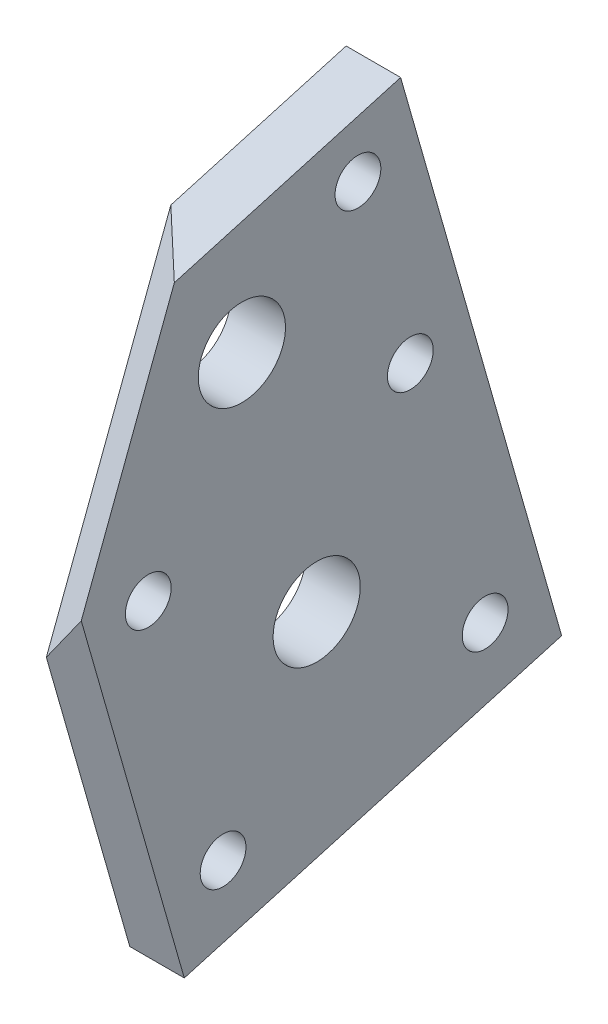
ISO-10303-21;
HEADER;
FILE_DESCRIPTION(('STEP AP214'),'2;1');
FILE_NAME('part.step','',(''),(''),'','','');
FILE_SCHEMA(('AUTOMOTIVE_DESIGN { 1 0 10303 214 1 1 1 1 }'));
ENDSEC;
DATA;
#1=APPLICATION_CONTEXT('core data for automotive mechanical design processes');
#2=APPLICATION_PROTOCOL_DEFINITION('international standard','automotive_design',2000,#1);
#3=PRODUCT_CONTEXT('',#1,'mechanical');
#4=PRODUCT('Part','Part','',(#3));
#5=PRODUCT_RELATED_PRODUCT_CATEGORY('part','',(#4));
#6=PRODUCT_DEFINITION_FORMATION('','',#4);
#7=PRODUCT_DEFINITION_CONTEXT('part definition',#1,'design');
#8=PRODUCT_DEFINITION('design','',#6,#7);
#9=PRODUCT_DEFINITION_SHAPE('','',#8);
#10=(LENGTH_UNIT() NAMED_UNIT(*) SI_UNIT(.MILLI.,.METRE.));
#11=(NAMED_UNIT(*) PLANE_ANGLE_UNIT() SI_UNIT($,.RADIAN.));
#12=(NAMED_UNIT(*) SI_UNIT($,.STERADIAN.) SOLID_ANGLE_UNIT());
#13=UNCERTAINTY_MEASURE_WITH_UNIT(LENGTH_MEASURE(1.E-05),#10,'distance_accuracy_value','');
#14=(GEOMETRIC_REPRESENTATION_CONTEXT(3) GLOBAL_UNCERTAINTY_ASSIGNED_CONTEXT((#13)) GLOBAL_UNIT_ASSIGNED_CONTEXT((#10,
#11,#12)) REPRESENTATION_CONTEXT('',''));
#15=CARTESIAN_POINT('',(0.,0.,0.));
#16=DIRECTION('',(0.,0.,1.));
#17=DIRECTION('',(1.,0.,0.));
#18=AXIS2_PLACEMENT_3D('',#15,#16,#17);
#19=CARTESIAN_POINT('',(-196.823635178426,3024.26393226236,-1427.03867727678));
#20=DIRECTION('',(1.,0.,0.));
#21=DIRECTION('',(0.,0.,-1.));
#22=AXIS2_PLACEMENT_3D('',#19,#20,#21);
#23=PLANE('',#22);
#24=CARTESIAN_POINT('',(-196.823635178426,3053.53065184557,-1506.59231650913));
#25=DIRECTION('',(-1.,0.,0.));
#26=DIRECTION('',(0.,0.,1.));
#27=AXIS2_PLACEMENT_3D('',#24,#25,#26);
#28=CIRCLE('',#27,2.09999999999971);
#29=CARTESIAN_POINT('',(-196.823635178426,3053.53065184557,-1504.49231650913));
#30=VERTEX_POINT('',#29);
#31=EDGE_CURVE('E185',#30,#30,#28,.T.);
#32=ORIENTED_EDGE('',*,*,#31,.F.);
#33=EDGE_LOOP('',(#32));
#34=FACE_BOUND('',#33,.T.);
#35=CARTESIAN_POINT('',(-196.823635178426,3062.11832189391,-1491.14071713753));
#36=DIRECTION('',(-1.,0.,0.));
#37=DIRECTION('',(0.,0.,1.));
#38=AXIS2_PLACEMENT_3D('',#35,#36,#37);
#39=CIRCLE('',#38,3.99999999999999);
#40=CARTESIAN_POINT('',(-196.823635178426,3062.11832189391,-1487.14071713753));
#41=VERTEX_POINT('',#40);
#42=EDGE_CURVE('E209',#41,#41,#39,.T.);
#43=ORIENTED_EDGE('',*,*,#42,.F.);
#44=EDGE_LOOP('',(#43));
#45=FACE_BOUND('',#44,.T.);
#46=CARTESIAN_POINT('',(-196.823635178426,3086.15759131387,-1484.27678781427));
#47=DIRECTION('',(-1.,0.,0.));
#48=DIRECTION('',(0.,0.,1.));
#49=AXIS2_PLACEMENT_3D('',#46,#47,#48);
#50=CIRCLE('',#49,3.99999999999936);
#51=CARTESIAN_POINT('',(-196.823635178426,3086.15759131387,-1480.27678781427));
#52=VERTEX_POINT('',#51);
#53=EDGE_CURVE('E203',#52,#52,#50,.T.);
#54=ORIENTED_EDGE('',*,*,#53,.F.);
#55=EDGE_LOOP('',(#54));
#56=FACE_BOUND('',#55,.T.);
#57=CARTESIAN_POINT('',(-196.823635178426,3094.39740985949,-1494.92363665959));
#58=DIRECTION('',(-1.,0.,0.));
#59=DIRECTION('',(0.,0.,1.));
#60=AXIS2_PLACEMENT_3D('',#57,#58,#59);
#61=CIRCLE('',#60,2.09999999999971);
#62=CARTESIAN_POINT('',(-196.823635178426,3094.39740985949,-1492.82363665959));
#63=VERTEX_POINT('',#62);
#64=EDGE_CURVE('E197',#63,#63,#61,.T.);
#65=ORIENTED_EDGE('',*,*,#64,.F.);
#66=EDGE_LOOP('',(#65));
#67=FACE_BOUND('',#66,.T.);
#68=CARTESIAN_POINT('',(-196.823635178426,3070.70599194226,-1475.68911776592));
#69=DIRECTION('',(-1.,0.,0.));
#70=DIRECTION('',(0.,0.,1.));
#71=AXIS2_PLACEMENT_3D('',#68,#69,#70);
#72=CIRCLE('',#71,2.09999999999949);
#73=CARTESIAN_POINT('',(-196.823635178426,3070.70599194226,-1473.58911776592));
#74=VERTEX_POINT('',#73);
#75=EDGE_CURVE('E196',#74,#74,#72,.T.);
#76=ORIENTED_EDGE('',*,*,#75,.F.);
#77=EDGE_LOOP('',(#76));
#78=FACE_BOUND('',#77,.T.);
#79=CARTESIAN_POINT('',(-196.823635178426,3077.56992126552,-1499.72838718587));
#80=DIRECTION('',(-1.,0.,0.));
#81=DIRECTION('',(0.,0.,1.));
#82=AXIS2_PLACEMENT_3D('',#79,#80,#81);
#83=CIRCLE('',#82,2.09999999999971);
#84=CARTESIAN_POINT('',(-196.823635178426,3077.56992126552,-1497.62838718587));
#85=VERTEX_POINT('',#84);
#86=EDGE_CURVE('E217',#85,#85,#83,.T.);
#87=ORIENTED_EDGE('',*,*,#86,.F.);
#88=EDGE_LOOP('',(#87));
#89=FACE_BOUND('',#88,.T.);
#90=CARTESIAN_POINT('',(-196.823635178426,3046.66672252231,-1482.55304708918));
#91=DIRECTION('',(-1.,0.,0.));
#92=DIRECTION('',(0.,0.,1.));
#93=AXIS2_PLACEMENT_3D('',#90,#91,#92);
#94=CIRCLE('',#93,2.09999999999971);
#95=CARTESIAN_POINT('',(-196.823635178426,3046.66672252231,-1480.45304708918));
#96=VERTEX_POINT('',#95);
#97=EDGE_CURVE('E190',#96,#96,#94,.T.);
#98=ORIENTED_EDGE('',*,*,#97,.F.);
#99=EDGE_LOOP('',(#98));
#100=FACE_BOUND('',#99,.T.);
#101=DIRECTION('',(0.,-0.935436603254689,0.35349449966206));
#102=VECTOR('',#101,1.);
#103=CARTESIAN_POINT('',(-196.823635178426,3014.81773659214,-1452.03572022903));
#104=LINE('',#103,#102);
#105=CARTESIAN_POINT('',(-196.823635178426,3096.12441201167,-1482.76090507492));
#106=VERTEX_POINT('',#105);
#107=CARTESIAN_POINT('',(-196.823635178426,3065.90337418166,-1471.34060079153));
#108=VERTEX_POINT('',#107);
#109=EDGE_CURVE('E48',#106,#108,#104,.T.);
#110=ORIENTED_EDGE('',*,*,#109,.F.);
#111=DIRECTION('',(0.,0.274557172930348,-0.961570776798305));
#112=VECTOR('',#111,1.);
#113=CARTESIAN_POINT('',(-196.823635178426,3075.99644005411,-1412.26750137312));
#114=LINE('',#113,#112);
#115=CARTESIAN_POINT('',(-196.823635178426,3100.7153281946,-1498.83949006733));
#116=VERTEX_POINT('',#115);
#117=EDGE_CURVE('E111',#106,#116,#114,.T.);
#118=ORIENTED_EDGE('',*,*,#117,.T.);
#119=DIRECTION('',(0.,-0.961570776798304,-0.27455717293035));
#120=VECTOR('',#119,1.);
#121=CARTESIAN_POINT('',(-196.823635178426,3048.98282040285,-1513.61066597098));
#122=LINE('',#121,#120);
#123=CARTESIAN_POINT('',(-196.823635178426,3048.98282040285,-1513.61066597098));
#124=VERTEX_POINT('',#123);
#125=EDGE_CURVE('E101',#116,#124,#122,.T.);
#126=ORIENTED_EDGE('',*,*,#125,.T.);
#127=DIRECTION('',(0.,0.274557172930348,-0.961570776798305));
#128=VECTOR('',#127,1.);
#129=CARTESIAN_POINT('',(-196.823635178426,3024.26393226236,-1427.03867727678));
#130=LINE('',#129,#128);
#131=CARTESIAN_POINT('',(-196.823635178426,3039.09876217736,-1478.99411800625));
#132=VERTEX_POINT('',#131);
#133=EDGE_CURVE('E71',#132,#124,#130,.T.);
#134=ORIENTED_EDGE('',*,*,#133,.F.);
#135=DIRECTION('',(0.,-0.961570776798303,-0.274557172930354));
#136=VECTOR('',#135,1.);
#137=CARTESIAN_POINT('',(-196.823635178426,3039.09876217736,-1478.99411800625));
#138=LINE('',#137,#136);
#139=EDGE_CURVE('E79',#108,#132,#138,.T.);
#140=ORIENTED_EDGE('',*,*,#139,.F.);
#141=EDGE_LOOP('',(#110,#118,#126,#134,#140));
#142=FACE_BOUND('',#141,.T.);
#143=ADVANCED_FACE('F33',(#34,#45,#56,#67,#78,#89,#100,#142),#23,.F.);
#144=CARTESIAN_POINT('',(-191.823635178426,3024.26393226236,-1427.03867727678));
#145=DIRECTION('',(-1.,0.,0.));
#146=DIRECTION('',(0.,0.,1.));
#147=AXIS2_PLACEMENT_3D('',#144,#145,#146);
#148=PLANE('',#147);
#149=CARTESIAN_POINT('',(-191.823635178426,3053.53065184557,-1506.59231650913));
#150=DIRECTION('',(-1.,0.,0.));
#151=DIRECTION('',(0.,0.,1.));
#152=AXIS2_PLACEMENT_3D('',#149,#150,#151);
#153=CIRCLE('',#152,2.09999999999971);
#154=CARTESIAN_POINT('',(-191.823635178426,3053.53065184557,-1504.49231650913));
#155=VERTEX_POINT('',#154);
#156=EDGE_CURVE('E95',#155,#155,#153,.T.);
#157=ORIENTED_EDGE('',*,*,#156,.T.);
#158=EDGE_LOOP('',(#157));
#159=FACE_BOUND('',#158,.T.);
#160=CARTESIAN_POINT('',(-191.823635178426,3062.11832189391,-1491.14071713753));
#161=DIRECTION('',(-1.,0.,0.));
#162=DIRECTION('',(0.,0.,1.));
#163=AXIS2_PLACEMENT_3D('',#160,#161,#162);
#164=CIRCLE('',#163,3.99999999999999);
#165=CARTESIAN_POINT('',(-191.823635178426,3062.11832189391,-1487.14071713753));
#166=VERTEX_POINT('',#165);
#167=EDGE_CURVE('E206',#166,#166,#164,.T.);
#168=ORIENTED_EDGE('',*,*,#167,.T.);
#169=EDGE_LOOP('',(#168));
#170=FACE_BOUND('',#169,.T.);
#171=CARTESIAN_POINT('',(-191.823635178426,3086.15759131387,-1484.27678781427));
#172=DIRECTION('',(-1.,0.,0.));
#173=DIRECTION('',(0.,0.,1.));
#174=AXIS2_PLACEMENT_3D('',#171,#172,#173);
#175=CIRCLE('',#174,3.99999999999936);
#176=CARTESIAN_POINT('',(-191.823635178426,3086.15759131387,-1480.27678781427));
#177=VERTEX_POINT('',#176);
#178=EDGE_CURVE('E200',#177,#177,#175,.T.);
#179=ORIENTED_EDGE('',*,*,#178,.T.);
#180=EDGE_LOOP('',(#179));
#181=FACE_BOUND('',#180,.T.);
#182=CARTESIAN_POINT('',(-191.823635178426,3094.39740985949,-1494.92363665959));
#183=DIRECTION('',(-1.,0.,0.));
#184=DIRECTION('',(0.,0.,1.));
#185=AXIS2_PLACEMENT_3D('',#182,#183,#184);
#186=CIRCLE('',#185,2.09999999999971);
#187=CARTESIAN_POINT('',(-191.823635178426,3094.39740985949,-1492.82363665959));
#188=VERTEX_POINT('',#187);
#189=EDGE_CURVE('E193',#188,#188,#186,.T.);
#190=ORIENTED_EDGE('',*,*,#189,.T.);
#191=EDGE_LOOP('',(#190));
#192=FACE_BOUND('',#191,.T.);
#193=CARTESIAN_POINT('',(-191.823635178426,3070.70599194226,-1475.68911776592));
#194=DIRECTION('',(-1.,0.,0.));
#195=DIRECTION('',(0.,0.,1.));
#196=AXIS2_PLACEMENT_3D('',#193,#194,#195);
#197=CIRCLE('',#196,2.09999999999949);
#198=CARTESIAN_POINT('',(-191.823635178426,3070.70599194226,-1473.58911776592));
#199=VERTEX_POINT('',#198);
#200=EDGE_CURVE('E220',#199,#199,#197,.T.);
#201=ORIENTED_EDGE('',*,*,#200,.T.);
#202=EDGE_LOOP('',(#201));
#203=FACE_BOUND('',#202,.T.);
#204=CARTESIAN_POINT('',(-191.823635178426,3077.56992126552,-1499.72838718587));
#205=DIRECTION('',(-1.,0.,0.));
#206=DIRECTION('',(0.,0.,1.));
#207=AXIS2_PLACEMENT_3D('',#204,#205,#206);
#208=CIRCLE('',#207,2.09999999999971);
#209=CARTESIAN_POINT('',(-191.823635178426,3077.56992126552,-1497.62838718587));
#210=VERTEX_POINT('',#209);
#211=EDGE_CURVE('E214',#210,#210,#208,.T.);
#212=ORIENTED_EDGE('',*,*,#211,.T.);
#213=EDGE_LOOP('',(#212));
#214=FACE_BOUND('',#213,.T.);
#215=CARTESIAN_POINT('',(-191.823635178426,3046.66672252231,-1482.55304708918));
#216=DIRECTION('',(-1.,0.,0.));
#217=DIRECTION('',(0.,0.,1.));
#218=AXIS2_PLACEMENT_3D('',#215,#216,#217);
#219=CIRCLE('',#218,2.09999999999971);
#220=CARTESIAN_POINT('',(-191.823635178426,3046.66672252231,-1480.45304708918));
#221=VERTEX_POINT('',#220);
#222=EDGE_CURVE('E186',#221,#221,#219,.T.);
#223=ORIENTED_EDGE('',*,*,#222,.T.);
#224=EDGE_LOOP('',(#223));
#225=FACE_BOUND('',#224,.T.);
#226=DIRECTION('',(0.,0.935436603254689,-0.35349449966206));
#227=VECTOR('',#226,1.);
#228=CARTESIAN_POINT('',(-191.823635178426,3016.19863745031,-1448.38150436587));
#229=LINE('',#228,#227);
#230=CARTESIAN_POINT('',(-191.823635178426,3072.19807880336,-1469.54327463825));
#231=VERTEX_POINT('',#230);
#232=CARTESIAN_POINT('',(-191.823635178426,3094.78780638869,-1478.07976382682));
#233=VERTEX_POINT('',#232);
#234=EDGE_CURVE('E90',#231,#233,#229,.T.);
#235=ORIENTED_EDGE('',*,*,#234,.F.);
#236=DIRECTION('',(0.,0.961570776798303,0.274557172930354));
#237=VECTOR('',#236,1.);
#238=CARTESIAN_POINT('',(-191.823635178426,3039.09876217736,-1478.99411800625));
#239=LINE('',#238,#237);
#240=CARTESIAN_POINT('',(-191.823635178426,3039.09876217736,-1478.99411800625));
#241=VERTEX_POINT('',#240);
#242=EDGE_CURVE('E41',#241,#231,#239,.T.);
#243=ORIENTED_EDGE('',*,*,#242,.F.);
#244=DIRECTION('',(0.,0.274557172930348,-0.961570776798305));
#245=VECTOR('',#244,1.);
#246=CARTESIAN_POINT('',(-191.823635178426,3024.26393226236,-1427.03867727678));
#247=LINE('',#246,#245);
#248=CARTESIAN_POINT('',(-191.823635178426,3048.98282040285,-1513.61066597098));
#249=VERTEX_POINT('',#248);
#250=EDGE_CURVE('E108',#241,#249,#247,.T.);
#251=ORIENTED_EDGE('',*,*,#250,.T.);
#252=DIRECTION('',(0.,0.961570776798304,0.27455717293035));
#253=VECTOR('',#252,1.);
#254=CARTESIAN_POINT('',(-191.823635178426,3048.98282040285,-1513.61066597098));
#255=LINE('',#254,#253);
#256=CARTESIAN_POINT('',(-191.823635178426,3100.7153281946,-1498.83949006733));
#257=VERTEX_POINT('',#256);
#258=EDGE_CURVE('E110',#249,#257,#255,.T.);
#259=ORIENTED_EDGE('',*,*,#258,.T.);
#260=DIRECTION('',(0.,0.274557172930348,-0.961570776798305));
#261=VECTOR('',#260,1.);
#262=CARTESIAN_POINT('',(-191.823635178426,3075.99644005411,-1412.26750137312));
#263=LINE('',#262,#261);
#264=EDGE_CURVE('E56',#233,#257,#263,.T.);
#265=ORIENTED_EDGE('',*,*,#264,.F.);
#266=EDGE_LOOP('',(#235,#243,#251,#259,#265));
#267=FACE_BOUND('',#266,.T.);
#268=ADVANCED_FACE('F93',(#159,#170,#181,#192,#203,#214,#225,#267),#148,.F.);
#269=CARTESIAN_POINT('',(-196.823635178426,3075.99644005411,-1412.26750137312));
#270=DIRECTION('',(0.,-0.961570776798305,-0.274557172930348));
#271=DIRECTION('',(0.,0.274557172930348,-0.961570776798305));
#272=AXIS2_PLACEMENT_3D('',#269,#270,#271);
#273=PLANE('',#272);
#274=DIRECTION('',(-0.716485352508744,0.191531670189707,-0.670793827457261));
#275=VECTOR('',#274,1.);
#276=CARTESIAN_POINT('',(-160.181367570731,3086.32915982701,-1448.45537901048));
#277=LINE('',#276,#275);
#278=EDGE_CURVE('E112',#233,#106,#277,.T.);
#279=ORIENTED_EDGE('',*,*,#278,.F.);
#280=ORIENTED_EDGE('',*,*,#264,.T.);
#281=DIRECTION('',(-1.,0.,0.));
#282=VECTOR('',#281,1.);
#283=CARTESIAN_POINT('',(-196.823635178426,3100.7153281946,-1498.83949006733));
#284=LINE('',#283,#282);
#285=EDGE_CURVE('E105',#257,#116,#284,.T.);
#286=ORIENTED_EDGE('',*,*,#285,.T.);
#287=ORIENTED_EDGE('',*,*,#117,.F.);
#288=EDGE_LOOP('',(#279,#280,#286,#287));
#289=FACE_BOUND('',#288,.T.);
#290=ADVANCED_FACE('F126',(#289),#273,.F.);
#291=CARTESIAN_POINT('',(-191.823635178426,3090.83126996911,-1464.22294210259));
#292=DIRECTION('',(0.,-0.274557172930354,0.961570776798303));
#293=DIRECTION('',(-1.,0.,0.));
#294=AXIS2_PLACEMENT_3D('',#291,#292,#293);
#295=PLANE('',#294);
#296=ORIENTED_EDGE('',*,*,#242,.T.);
#297=DIRECTION('',(-0.606992432871464,-0.764167614507352,-0.21819267488833));
#298=VECTOR('',#297,1.);
#299=CARTESIAN_POINT('',(-182.476110239789,3083.96606048991,-1466.18316443013));
#300=LINE('',#299,#298);
#301=EDGE_CURVE('E11',#231,#108,#300,.T.);
#302=ORIENTED_EDGE('',*,*,#301,.T.);
#303=ORIENTED_EDGE('',*,*,#139,.T.);
#304=DIRECTION('',(1.,0.,0.));
#305=VECTOR('',#304,1.);
#306=CARTESIAN_POINT('',(-196.823635178426,3039.09876217736,-1478.99411800625));
#307=LINE('',#306,#305);
#308=EDGE_CURVE('E97',#132,#241,#307,.T.);
#309=ORIENTED_EDGE('',*,*,#308,.T.);
#310=EDGE_LOOP('',(#296,#302,#303,#309));
#311=FACE_BOUND('',#310,.T.);
#312=ADVANCED_FACE('F35',(#311),#295,.T.);
#313=CARTESIAN_POINT('',(-196.823635178426,3024.26393226236,-1427.03867727678));
#314=DIRECTION('',(0.,0.961570776798305,0.274557172930348));
#315=DIRECTION('',(0.,-0.274557172930348,0.961570776798305));
#316=AXIS2_PLACEMENT_3D('',#313,#314,#315);
#317=PLANE('',#316);
#318=ORIENTED_EDGE('',*,*,#308,.F.);
#319=ORIENTED_EDGE('',*,*,#133,.T.);
#320=DIRECTION('',(1.,0.,0.));
#321=VECTOR('',#320,1.);
#322=CARTESIAN_POINT('',(-196.823635178426,3048.98282040285,-1513.61066597098));
#323=LINE('',#322,#321);
#324=EDGE_CURVE('E107',#124,#249,#323,.T.);
#325=ORIENTED_EDGE('',*,*,#324,.T.);
#326=ORIENTED_EDGE('',*,*,#250,.F.);
#327=EDGE_LOOP('',(#318,#319,#325,#326));
#328=FACE_BOUND('',#327,.T.);
#329=ADVANCED_FACE('F121',(#328),#317,.F.);
#330=CARTESIAN_POINT('',(0.,629.439859667794,-2204.46243800054));
#331=DIRECTION('',(0.,0.27455717293035,-0.961570776798304));
#332=DIRECTION('',(0.,0.961570776798304,0.27455717293035));
#333=AXIS2_PLACEMENT_3D('',#330,#331,#332);
#334=PLANE('',#333);
#335=ORIENTED_EDGE('',*,*,#125,.F.);
#336=ORIENTED_EDGE('',*,*,#285,.F.);
#337=ORIENTED_EDGE('',*,*,#258,.F.);
#338=ORIENTED_EDGE('',*,*,#324,.F.);
#339=EDGE_LOOP('',(#335,#336,#337,#338));
#340=FACE_BOUND('',#339,.T.);
#341=ADVANCED_FACE('F125',(#340),#334,.T.);
#342=CARTESIAN_POINT('',(67.3338647444513,-30.4653637806914,-80.6191226148435));
#343=DIRECTION('',(-0.61566147532566,0.27855746707453,0.737134102682038));
#344=DIRECTION('',(0.767512586022477,0.,0.641033876091654));
#345=AXIS2_PLACEMENT_3D('',#342,#343,#344);
#346=PLANE('',#345);
#347=ORIENTED_EDGE('',*,*,#278,.T.);
#348=ORIENTED_EDGE('',*,*,#109,.T.);
#349=ORIENTED_EDGE('',*,*,#301,.F.);
#350=ORIENTED_EDGE('',*,*,#234,.T.);
#351=EDGE_LOOP('',(#347,#348,#349,#350));
#352=FACE_BOUND('',#351,.T.);
#353=ADVANCED_FACE('F89',(#352),#346,.T.);
#354=CARTESIAN_POINT('',(-191.823635178426,3046.66672252231,-1482.55304708918));
#355=DIRECTION('',(-1.,0.,0.));
#356=DIRECTION('',(0.,0.,1.));
#357=AXIS2_PLACEMENT_3D('',#354,#355,#356);
#358=CYLINDRICAL_SURFACE('',#357,2.09999999999971);
#359=ORIENTED_EDGE('',*,*,#222,.F.);
#360=EDGE_LOOP('',(#359));
#361=FACE_BOUND('',#360,.T.);
#362=ORIENTED_EDGE('',*,*,#97,.T.);
#363=EDGE_LOOP('',(#362));
#364=FACE_BOUND('',#363,.T.);
#365=ADVANCED_FACE('F150',(#361,#364),#358,.F.);
#366=CARTESIAN_POINT('',(-191.823635178426,3077.56992126552,-1499.72838718587));
#367=DIRECTION('',(-1.,0.,0.));
#368=DIRECTION('',(0.,0.,1.));
#369=AXIS2_PLACEMENT_3D('',#366,#367,#368);
#370=CYLINDRICAL_SURFACE('',#369,2.09999999999971);
#371=ORIENTED_EDGE('',*,*,#211,.F.);
#372=EDGE_LOOP('',(#371));
#373=FACE_BOUND('',#372,.T.);
#374=ORIENTED_EDGE('',*,*,#86,.T.);
#375=EDGE_LOOP('',(#374));
#376=FACE_BOUND('',#375,.T.);
#377=ADVANCED_FACE('F157',(#373,#376),#370,.F.);
#378=CARTESIAN_POINT('',(-191.823635178426,3070.70599194226,-1475.68911776592));
#379=DIRECTION('',(-1.,0.,0.));
#380=DIRECTION('',(0.,0.,1.));
#381=AXIS2_PLACEMENT_3D('',#378,#379,#380);
#382=CYLINDRICAL_SURFACE('',#381,2.09999999999949);
#383=ORIENTED_EDGE('',*,*,#200,.F.);
#384=EDGE_LOOP('',(#383));
#385=FACE_BOUND('',#384,.T.);
#386=ORIENTED_EDGE('',*,*,#75,.T.);
#387=EDGE_LOOP('',(#386));
#388=FACE_BOUND('',#387,.T.);
#389=ADVANCED_FACE('F153',(#385,#388),#382,.F.);
#390=CARTESIAN_POINT('',(-191.823635178426,3094.39740985949,-1494.92363665959));
#391=DIRECTION('',(-1.,0.,0.));
#392=DIRECTION('',(0.,0.,1.));
#393=AXIS2_PLACEMENT_3D('',#390,#391,#392);
#394=CYLINDRICAL_SURFACE('',#393,2.09999999999971);
#395=ORIENTED_EDGE('',*,*,#189,.F.);
#396=EDGE_LOOP('',(#395));
#397=FACE_BOUND('',#396,.T.);
#398=ORIENTED_EDGE('',*,*,#64,.T.);
#399=EDGE_LOOP('',(#398));
#400=FACE_BOUND('',#399,.T.);
#401=ADVANCED_FACE('F156',(#397,#400),#394,.F.);
#402=CARTESIAN_POINT('',(-191.823635178426,3086.15759131387,-1484.27678781427));
#403=DIRECTION('',(-1.,0.,0.));
#404=DIRECTION('',(0.,0.,1.));
#405=AXIS2_PLACEMENT_3D('',#402,#403,#404);
#406=CYLINDRICAL_SURFACE('',#405,3.99999999999936);
#407=ORIENTED_EDGE('',*,*,#178,.F.);
#408=EDGE_LOOP('',(#407));
#409=FACE_BOUND('',#408,.T.);
#410=ORIENTED_EDGE('',*,*,#53,.T.);
#411=EDGE_LOOP('',(#410));
#412=FACE_BOUND('',#411,.T.);
#413=ADVANCED_FACE('F169',(#409,#412),#406,.F.);
#414=CARTESIAN_POINT('',(-191.823635178426,3062.11832189391,-1491.14071713753));
#415=DIRECTION('',(-1.,0.,0.));
#416=DIRECTION('',(0.,0.,1.));
#417=AXIS2_PLACEMENT_3D('',#414,#415,#416);
#418=CYLINDRICAL_SURFACE('',#417,3.99999999999999);
#419=ORIENTED_EDGE('',*,*,#167,.F.);
#420=EDGE_LOOP('',(#419));
#421=FACE_BOUND('',#420,.T.);
#422=ORIENTED_EDGE('',*,*,#42,.T.);
#423=EDGE_LOOP('',(#422));
#424=FACE_BOUND('',#423,.T.);
#425=ADVANCED_FACE('F165',(#421,#424),#418,.F.);
#426=CARTESIAN_POINT('',(-191.823635178426,3053.53065184557,-1506.59231650913));
#427=DIRECTION('',(-1.,0.,0.));
#428=DIRECTION('',(0.,0.,1.));
#429=AXIS2_PLACEMENT_3D('',#426,#427,#428);
#430=CYLINDRICAL_SURFACE('',#429,2.09999999999971);
#431=ORIENTED_EDGE('',*,*,#156,.F.);
#432=EDGE_LOOP('',(#431));
#433=FACE_BOUND('',#432,.T.);
#434=ORIENTED_EDGE('',*,*,#31,.T.);
#435=EDGE_LOOP('',(#434));
#436=FACE_BOUND('',#435,.T.);
#437=ADVANCED_FACE('F168',(#433,#436),#430,.F.);
#438=CLOSED_SHELL('',(#143,#268,#290,#312,#329,#341,#353,#365,#377,#389,#401,#413,#425,#437));
#439=MANIFOLD_SOLID_BREP('B2',#438);
#440=ADVANCED_BREP_SHAPE_REPRESENTATION('',(#18,#439),#14);
#441=SHAPE_DEFINITION_REPRESENTATION(#9,#440);
ENDSEC;
END-ISO-10303-21;
